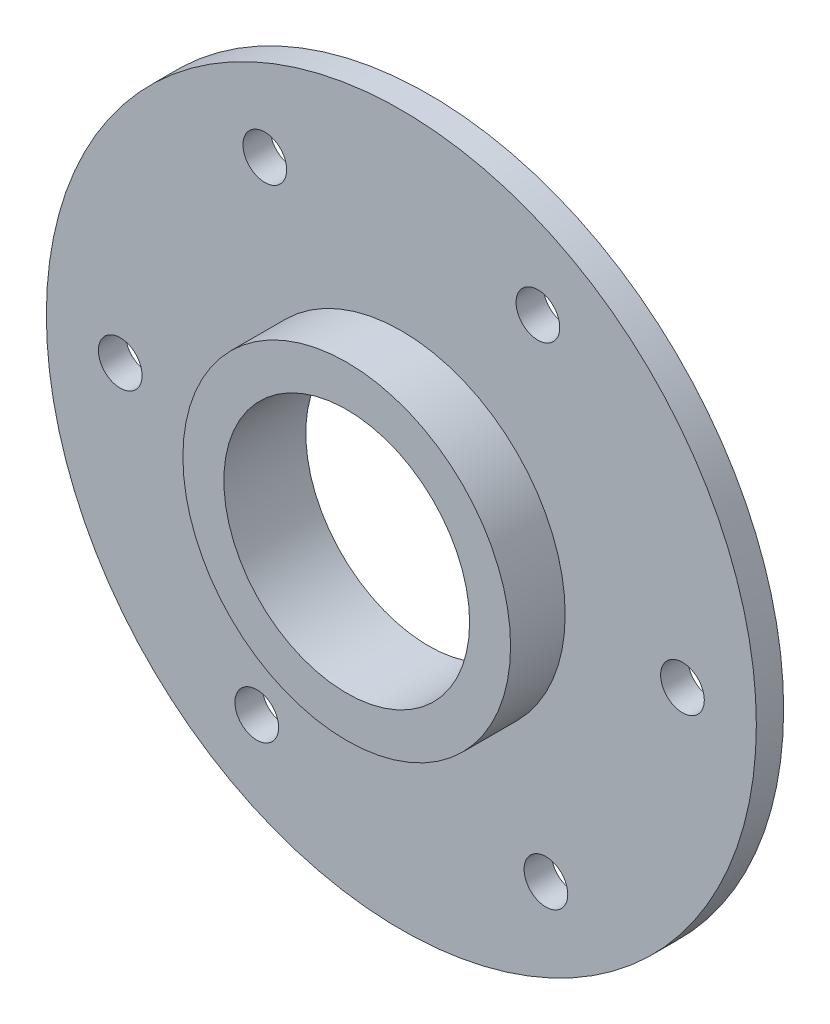
ISO-10303-21;
HEADER;
FILE_DESCRIPTION(('STEP AP214'),'2;1');
FILE_NAME('part.step','',(''),(''),'','','');
FILE_SCHEMA(('AUTOMOTIVE_DESIGN { 1 0 10303 214 1 1 1 1 }'));
ENDSEC;
DATA;
#1=APPLICATION_CONTEXT('core data for automotive mechanical design processes');
#2=APPLICATION_PROTOCOL_DEFINITION('international standard','automotive_design',2000,#1);
#3=PRODUCT_CONTEXT('',#1,'mechanical');
#4=PRODUCT('Part','Part','',(#3));
#5=PRODUCT_RELATED_PRODUCT_CATEGORY('part','',(#4));
#6=PRODUCT_DEFINITION_FORMATION('','',#4);
#7=PRODUCT_DEFINITION_CONTEXT('part definition',#1,'design');
#8=PRODUCT_DEFINITION('design','',#6,#7);
#9=PRODUCT_DEFINITION_SHAPE('','',#8);
#10=(LENGTH_UNIT() NAMED_UNIT(*) SI_UNIT(.MILLI.,.METRE.));
#11=(NAMED_UNIT(*) PLANE_ANGLE_UNIT() SI_UNIT($,.RADIAN.));
#12=(NAMED_UNIT(*) SI_UNIT($,.STERADIAN.) SOLID_ANGLE_UNIT());
#13=UNCERTAINTY_MEASURE_WITH_UNIT(LENGTH_MEASURE(1.E-05),#10,'distance_accuracy_value','');
#14=(GEOMETRIC_REPRESENTATION_CONTEXT(3) GLOBAL_UNCERTAINTY_ASSIGNED_CONTEXT((#13)) GLOBAL_UNIT_ASSIGNED_CONTEXT((#10,
#11,#12)) REPRESENTATION_CONTEXT('',''));
#15=CARTESIAN_POINT('',(0.,0.,0.));
#16=DIRECTION('',(0.,0.,1.));
#17=DIRECTION('',(1.,0.,0.));
#18=AXIS2_PLACEMENT_3D('',#15,#16,#17);
#19=CARTESIAN_POINT('',(0.,0.,0.));
#20=DIRECTION('',(0.,0.,1.));
#21=DIRECTION('',(1.,0.,0.));
#22=AXIS2_PLACEMENT_3D('',#19,#20,#21);
#23=CYLINDRICAL_SURFACE('',#22,65.);
#24=CARTESIAN_POINT('',(0.,0.,0.));
#25=DIRECTION('',(0.,0.,1.));
#26=DIRECTION('',(1.,0.,0.));
#27=AXIS2_PLACEMENT_3D('',#24,#25,#26);
#28=CIRCLE('',#27,65.);
#29=CARTESIAN_POINT('',(65.,0.,0.));
#30=VERTEX_POINT('',#29);
#31=EDGE_CURVE('E10',#30,#30,#28,.T.);
#32=ORIENTED_EDGE('',*,*,#31,.T.);
#33=EDGE_LOOP('',(#32));
#34=FACE_BOUND('',#33,.T.);
#35=CARTESIAN_POINT('',(0.,0.,5.));
#36=DIRECTION('',(0.,0.,1.));
#37=DIRECTION('',(1.,0.,0.));
#38=AXIS2_PLACEMENT_3D('',#35,#36,#37);
#39=CIRCLE('',#38,65.);
#40=CARTESIAN_POINT('',(65.,0.,5.));
#41=VERTEX_POINT('',#40);
#42=EDGE_CURVE('E40',#41,#41,#39,.T.);
#43=ORIENTED_EDGE('',*,*,#42,.F.);
#44=EDGE_LOOP('',(#43));
#45=FACE_BOUND('',#44,.T.);
#46=ADVANCED_FACE('F37',(#34,#45),#23,.T.);
#47=CARTESIAN_POINT('',(0.,0.,0.));
#48=DIRECTION('',(0.,0.,1.));
#49=DIRECTION('',(1.,0.,0.));
#50=AXIS2_PLACEMENT_3D('',#47,#48,#49);
#51=PLANE('',#50);
#52=CARTESIAN_POINT('',(0.,0.,0.));
#53=DIRECTION('',(0.,0.,1.));
#54=DIRECTION('',(1.,0.,0.));
#55=AXIS2_PLACEMENT_3D('',#52,#53,#54);
#56=CIRCLE('',#55,22.5);
#57=CARTESIAN_POINT('',(22.5,0.,0.));
#58=VERTEX_POINT('',#57);
#59=EDGE_CURVE('E103',#58,#58,#56,.T.);
#60=ORIENTED_EDGE('',*,*,#59,.T.);
#61=EDGE_LOOP('',(#60));
#62=FACE_BOUND('',#61,.T.);
#63=CARTESIAN_POINT('',(-51.4711431702987,-0.849364905388506,0.));
#64=DIRECTION('',(0.,0.,1.));
#65=DIRECTION('',(1.,0.,0.));
#66=AXIS2_PLACEMENT_3D('',#63,#64,#65);
#67=CIRCLE('',#66,4.);
#68=CARTESIAN_POINT('',(-47.4711431702987,-0.849364905388506,0.));
#69=VERTEX_POINT('',#68);
#70=EDGE_CURVE('E49',#69,#69,#67,.T.);
#71=ORIENTED_EDGE('',*,*,#70,.T.);
#72=EDGE_LOOP('',(#71));
#73=FACE_BOUND('',#72,.T.);
#74=CARTESIAN_POINT('',(-26.4711431702987,-44.1506350946104,0.));
#75=DIRECTION('',(0.,0.,1.));
#76=DIRECTION('',(1.,0.,0.));
#77=AXIS2_PLACEMENT_3D('',#74,#75,#76);
#78=CIRCLE('',#77,4.);
#79=CARTESIAN_POINT('',(-22.4711431702987,-44.1506350946104,0.));
#80=VERTEX_POINT('',#79);
#81=EDGE_CURVE('E54',#80,#80,#78,.T.);
#82=ORIENTED_EDGE('',*,*,#81,.T.);
#83=EDGE_LOOP('',(#82));
#84=FACE_BOUND('',#83,.T.);
#85=CARTESIAN_POINT('',(26.4711431702998,-44.1506350946098,0.));
#86=DIRECTION('',(0.,0.,1.));
#87=DIRECTION('',(1.,0.,0.));
#88=AXIS2_PLACEMENT_3D('',#85,#86,#87);
#89=CIRCLE('',#88,4.);
#90=CARTESIAN_POINT('',(30.4711431702998,-44.1506350946098,0.));
#91=VERTEX_POINT('',#90);
#92=EDGE_CURVE('E58',#91,#91,#89,.T.);
#93=ORIENTED_EDGE('',*,*,#92,.T.);
#94=EDGE_LOOP('',(#93));
#95=FACE_BOUND('',#94,.T.);
#96=CARTESIAN_POINT('',(51.4711431702998,-0.849364905387864,0.));
#97=DIRECTION('',(0.,0.,1.));
#98=DIRECTION('',(1.,0.,0.));
#99=AXIS2_PLACEMENT_3D('',#96,#97,#98);
#100=CIRCLE('',#99,4.00000000000001);
#101=CARTESIAN_POINT('',(55.4711431702998,-0.849364905387864,0.));
#102=VERTEX_POINT('',#101);
#103=EDGE_CURVE('E62',#102,#102,#100,.T.);
#104=ORIENTED_EDGE('',*,*,#103,.T.);
#105=EDGE_LOOP('',(#104));
#106=FACE_BOUND('',#105,.T.);
#107=CARTESIAN_POINT('',(25.,45.,0.));
#108=DIRECTION('',(0.,0.,1.));
#109=DIRECTION('',(1.,0.,0.));
#110=AXIS2_PLACEMENT_3D('',#107,#108,#109);
#111=CIRCLE('',#110,4.);
#112=CARTESIAN_POINT('',(29.,45.,0.));
#113=VERTEX_POINT('',#112);
#114=EDGE_CURVE('E66',#113,#113,#111,.T.);
#115=ORIENTED_EDGE('',*,*,#114,.T.);
#116=EDGE_LOOP('',(#115));
#117=FACE_BOUND('',#116,.T.);
#118=CARTESIAN_POINT('',(-25.,45.,0.));
#119=DIRECTION('',(0.,0.,1.));
#120=DIRECTION('',(1.,0.,0.));
#121=AXIS2_PLACEMENT_3D('',#118,#119,#120);
#122=CIRCLE('',#121,4.);
#123=CARTESIAN_POINT('',(-21.,45.,0.));
#124=VERTEX_POINT('',#123);
#125=EDGE_CURVE('E70',#124,#124,#122,.T.);
#126=ORIENTED_EDGE('',*,*,#125,.T.);
#127=EDGE_LOOP('',(#126));
#128=FACE_BOUND('',#127,.T.);
#129=ORIENTED_EDGE('',*,*,#31,.F.);
#130=EDGE_LOOP('',(#129));
#131=FACE_BOUND('',#130,.T.);
#132=ADVANCED_FACE('F115',(#62,#73,#84,#95,#106,#117,#128,#131),#51,.F.);
#133=CARTESIAN_POINT('',(0.,0.,5.));
#134=DIRECTION('',(0.,0.,1.));
#135=DIRECTION('',(1.,0.,0.));
#136=AXIS2_PLACEMENT_3D('',#133,#134,#135);
#137=PLANE('',#136);
#138=CARTESIAN_POINT('',(0.,0.,5.));
#139=DIRECTION('',(0.,0.,1.));
#140=DIRECTION('',(1.,0.,0.));
#141=AXIS2_PLACEMENT_3D('',#138,#139,#140);
#142=CIRCLE('',#141,30.);
#143=CARTESIAN_POINT('',(30.,0.,5.));
#144=VERTEX_POINT('',#143);
#145=EDGE_CURVE('E99',#144,#144,#142,.T.);
#146=ORIENTED_EDGE('',*,*,#145,.F.);
#147=EDGE_LOOP('',(#146));
#148=FACE_BOUND('',#147,.T.);
#149=CARTESIAN_POINT('',(-51.4711431702987,-0.849364905388506,5.));
#150=DIRECTION('',(0.,0.,1.));
#151=DIRECTION('',(1.,0.,0.));
#152=AXIS2_PLACEMENT_3D('',#149,#150,#151);
#153=CIRCLE('',#152,4.);
#154=CARTESIAN_POINT('',(-47.4711431702987,-0.849364905388506,5.));
#155=VERTEX_POINT('',#154);
#156=EDGE_CURVE('E79',#155,#155,#153,.T.);
#157=ORIENTED_EDGE('',*,*,#156,.F.);
#158=EDGE_LOOP('',(#157));
#159=FACE_BOUND('',#158,.T.);
#160=CARTESIAN_POINT('',(-26.4711431702987,-44.1506350946104,5.));
#161=DIRECTION('',(0.,0.,1.));
#162=DIRECTION('',(1.,0.,0.));
#163=AXIS2_PLACEMENT_3D('',#160,#161,#162);
#164=CIRCLE('',#163,4.);
#165=CARTESIAN_POINT('',(-22.4711431702987,-44.1506350946104,5.));
#166=VERTEX_POINT('',#165);
#167=EDGE_CURVE('E83',#166,#166,#164,.T.);
#168=ORIENTED_EDGE('',*,*,#167,.F.);
#169=EDGE_LOOP('',(#168));
#170=FACE_BOUND('',#169,.T.);
#171=CARTESIAN_POINT('',(26.4711431702998,-44.1506350946098,5.));
#172=DIRECTION('',(0.,0.,1.));
#173=DIRECTION('',(1.,0.,0.));
#174=AXIS2_PLACEMENT_3D('',#171,#172,#173);
#175=CIRCLE('',#174,4.);
#176=CARTESIAN_POINT('',(30.4711431702998,-44.1506350946098,5.));
#177=VERTEX_POINT('',#176);
#178=EDGE_CURVE('E88',#177,#177,#175,.T.);
#179=ORIENTED_EDGE('',*,*,#178,.F.);
#180=EDGE_LOOP('',(#179));
#181=FACE_BOUND('',#180,.T.);
#182=CARTESIAN_POINT('',(51.4711431702998,-0.849364905387864,5.));
#183=DIRECTION('',(0.,0.,1.));
#184=DIRECTION('',(1.,0.,0.));
#185=AXIS2_PLACEMENT_3D('',#182,#183,#184);
#186=CIRCLE('',#185,4.00000000000001);
#187=CARTESIAN_POINT('',(55.4711431702998,-0.849364905387864,5.));
#188=VERTEX_POINT('',#187);
#189=EDGE_CURVE('E92',#188,#188,#186,.T.);
#190=ORIENTED_EDGE('',*,*,#189,.F.);
#191=EDGE_LOOP('',(#190));
#192=FACE_BOUND('',#191,.T.);
#193=CARTESIAN_POINT('',(25.,45.,5.));
#194=DIRECTION('',(0.,0.,1.));
#195=DIRECTION('',(1.,0.,0.));
#196=AXIS2_PLACEMENT_3D('',#193,#194,#195);
#197=CIRCLE('',#196,4.);
#198=CARTESIAN_POINT('',(29.,45.,5.));
#199=VERTEX_POINT('',#198);
#200=EDGE_CURVE('E78',#199,#199,#197,.T.);
#201=ORIENTED_EDGE('',*,*,#200,.F.);
#202=EDGE_LOOP('',(#201));
#203=FACE_BOUND('',#202,.T.);
#204=CARTESIAN_POINT('',(-25.,45.,5.));
#205=DIRECTION('',(0.,0.,1.));
#206=DIRECTION('',(1.,0.,0.));
#207=AXIS2_PLACEMENT_3D('',#204,#205,#206);
#208=CIRCLE('',#207,4.);
#209=CARTESIAN_POINT('',(-21.,45.,5.));
#210=VERTEX_POINT('',#209);
#211=EDGE_CURVE('E74',#210,#210,#208,.T.);
#212=ORIENTED_EDGE('',*,*,#211,.F.);
#213=EDGE_LOOP('',(#212));
#214=FACE_BOUND('',#213,.T.);
#215=ORIENTED_EDGE('',*,*,#42,.T.);
#216=EDGE_LOOP('',(#215));
#217=FACE_BOUND('',#216,.T.);
#218=ADVANCED_FACE('F137',(#148,#159,#170,#181,#192,#203,#214,#217),#137,.T.);
#219=CARTESIAN_POINT('',(-25.,45.,-5.));
#220=DIRECTION('',(0.,0.,1.));
#221=DIRECTION('',(1.,0.,0.));
#222=AXIS2_PLACEMENT_3D('',#219,#220,#221);
#223=CYLINDRICAL_SURFACE('',#222,4.);
#224=ORIENTED_EDGE('',*,*,#211,.T.);
#225=EDGE_LOOP('',(#224));
#226=FACE_BOUND('',#225,.T.);
#227=ORIENTED_EDGE('',*,*,#125,.F.);
#228=EDGE_LOOP('',(#227));
#229=FACE_BOUND('',#228,.T.);
#230=ADVANCED_FACE('F140',(#226,#229),#223,.F.);
#231=CARTESIAN_POINT('',(25.,45.,-5.));
#232=DIRECTION('',(0.,0.,1.));
#233=DIRECTION('',(1.,0.,0.));
#234=AXIS2_PLACEMENT_3D('',#231,#232,#233);
#235=CYLINDRICAL_SURFACE('',#234,4.);
#236=ORIENTED_EDGE('',*,*,#200,.T.);
#237=EDGE_LOOP('',(#236));
#238=FACE_BOUND('',#237,.T.);
#239=ORIENTED_EDGE('',*,*,#114,.F.);
#240=EDGE_LOOP('',(#239));
#241=FACE_BOUND('',#240,.T.);
#242=ADVANCED_FACE('F165',(#238,#241),#235,.F.);
#243=CARTESIAN_POINT('',(51.4711431702998,-0.849364905387864,-5.));
#244=DIRECTION('',(0.,0.,1.));
#245=DIRECTION('',(1.,0.,0.));
#246=AXIS2_PLACEMENT_3D('',#243,#244,#245);
#247=CYLINDRICAL_SURFACE('',#246,4.00000000000001);
#248=ORIENTED_EDGE('',*,*,#189,.T.);
#249=EDGE_LOOP('',(#248));
#250=FACE_BOUND('',#249,.T.);
#251=ORIENTED_EDGE('',*,*,#103,.F.);
#252=EDGE_LOOP('',(#251));
#253=FACE_BOUND('',#252,.T.);
#254=ADVANCED_FACE('F177',(#250,#253),#247,.F.);
#255=CARTESIAN_POINT('',(26.4711431702998,-44.1506350946098,-5.));
#256=DIRECTION('',(0.,0.,1.));
#257=DIRECTION('',(1.,0.,0.));
#258=AXIS2_PLACEMENT_3D('',#255,#256,#257);
#259=CYLINDRICAL_SURFACE('',#258,4.);
#260=ORIENTED_EDGE('',*,*,#178,.T.);
#261=EDGE_LOOP('',(#260));
#262=FACE_BOUND('',#261,.T.);
#263=ORIENTED_EDGE('',*,*,#92,.F.);
#264=EDGE_LOOP('',(#263));
#265=FACE_BOUND('',#264,.T.);
#266=ADVANCED_FACE('F173',(#262,#265),#259,.F.);
#267=CARTESIAN_POINT('',(-26.4711431702987,-44.1506350946104,-5.));
#268=DIRECTION('',(0.,0.,1.));
#269=DIRECTION('',(1.,0.,0.));
#270=AXIS2_PLACEMENT_3D('',#267,#268,#269);
#271=CYLINDRICAL_SURFACE('',#270,4.);
#272=ORIENTED_EDGE('',*,*,#167,.T.);
#273=EDGE_LOOP('',(#272));
#274=FACE_BOUND('',#273,.T.);
#275=ORIENTED_EDGE('',*,*,#81,.F.);
#276=EDGE_LOOP('',(#275));
#277=FACE_BOUND('',#276,.T.);
#278=ADVANCED_FACE('F169',(#274,#277),#271,.F.);
#279=CARTESIAN_POINT('',(-51.4711431702987,-0.849364905388506,-5.));
#280=DIRECTION('',(0.,0.,1.));
#281=DIRECTION('',(1.,0.,0.));
#282=AXIS2_PLACEMENT_3D('',#279,#280,#281);
#283=CYLINDRICAL_SURFACE('',#282,4.);
#284=ORIENTED_EDGE('',*,*,#156,.T.);
#285=EDGE_LOOP('',(#284));
#286=FACE_BOUND('',#285,.T.);
#287=ORIENTED_EDGE('',*,*,#70,.F.);
#288=EDGE_LOOP('',(#287));
#289=FACE_BOUND('',#288,.T.);
#290=ADVANCED_FACE('F133',(#286,#289),#283,.F.);
#291=CARTESIAN_POINT('',(0.,0.,15.));
#292=DIRECTION('',(0.,0.,-1.));
#293=DIRECTION('',(-1.,0.,0.));
#294=AXIS2_PLACEMENT_3D('',#291,#292,#293);
#295=CYLINDRICAL_SURFACE('',#294,30.);
#296=CARTESIAN_POINT('',(0.,0.,15.));
#297=DIRECTION('',(0.,0.,1.));
#298=DIRECTION('',(1.,0.,0.));
#299=AXIS2_PLACEMENT_3D('',#296,#297,#298);
#300=CIRCLE('',#299,30.);
#301=CARTESIAN_POINT('',(30.,0.,15.));
#302=VERTEX_POINT('',#301);
#303=EDGE_CURVE('E84',#302,#302,#300,.T.);
#304=ORIENTED_EDGE('',*,*,#303,.F.);
#305=EDGE_LOOP('',(#304));
#306=FACE_BOUND('',#305,.T.);
#307=ORIENTED_EDGE('',*,*,#145,.T.);
#308=EDGE_LOOP('',(#307));
#309=FACE_BOUND('',#308,.T.);
#310=ADVANCED_FACE('F127',(#306,#309),#295,.T.);
#311=CARTESIAN_POINT('',(0.,0.,15.));
#312=DIRECTION('',(0.,0.,1.));
#313=DIRECTION('',(1.,0.,0.));
#314=AXIS2_PLACEMENT_3D('',#311,#312,#313);
#315=PLANE('',#314);
#316=CARTESIAN_POINT('',(0.,0.,15.));
#317=DIRECTION('',(0.,0.,1.));
#318=DIRECTION('',(1.,0.,0.));
#319=AXIS2_PLACEMENT_3D('',#316,#317,#318);
#320=CIRCLE('',#319,22.5);
#321=CARTESIAN_POINT('',(22.5,0.,15.));
#322=VERTEX_POINT('',#321);
#323=EDGE_CURVE('E107',#322,#322,#320,.T.);
#324=ORIENTED_EDGE('',*,*,#323,.F.);
#325=EDGE_LOOP('',(#324));
#326=FACE_BOUND('',#325,.T.);
#327=ORIENTED_EDGE('',*,*,#303,.T.);
#328=EDGE_LOOP('',(#327));
#329=FACE_BOUND('',#328,.T.);
#330=ADVANCED_FACE('F121',(#326,#329),#315,.T.);
#331=CARTESIAN_POINT('',(0.,0.,0.));
#332=DIRECTION('',(0.,0.,1.));
#333=DIRECTION('',(1.,0.,0.));
#334=AXIS2_PLACEMENT_3D('',#331,#332,#333);
#335=CYLINDRICAL_SURFACE('',#334,22.5);
#336=ORIENTED_EDGE('',*,*,#59,.F.);
#337=EDGE_LOOP('',(#336));
#338=FACE_BOUND('',#337,.T.);
#339=ORIENTED_EDGE('',*,*,#323,.T.);
#340=EDGE_LOOP('',(#339));
#341=FACE_BOUND('',#340,.T.);
#342=ADVANCED_FACE('F118',(#338,#341),#335,.F.);
#343=CLOSED_SHELL('',(#46,#132,#218,#230,#242,#254,#266,#278,#290,#310,#330,#342));
#344=MANIFOLD_SOLID_BREP('B2',#343);
#345=ADVANCED_BREP_SHAPE_REPRESENTATION('',(#18,#344),#14);
#346=SHAPE_DEFINITION_REPRESENTATION(#9,#345);
ENDSEC;
END-ISO-10303-21;
